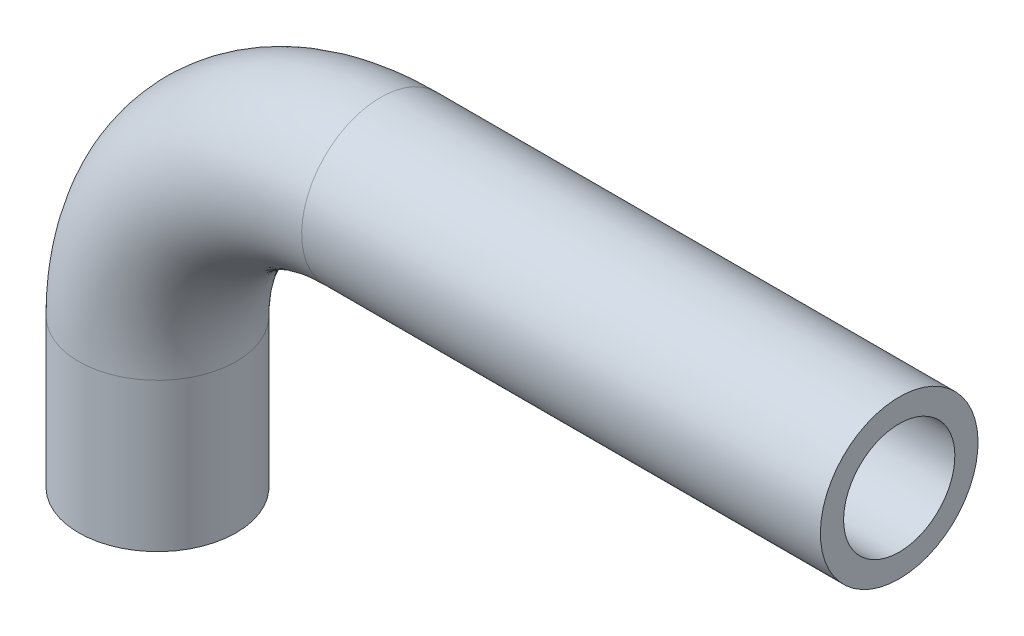
ISO-10303-21;
HEADER;
FILE_DESCRIPTION(('STEP AP214'),'2;1');
FILE_NAME('part.step','',(''),(''),'','','');
FILE_SCHEMA(('AUTOMOTIVE_DESIGN { 1 0 10303 214 1 1 1 1 }'));
ENDSEC;
DATA;
#1=APPLICATION_CONTEXT('core data for automotive mechanical design processes');
#2=APPLICATION_PROTOCOL_DEFINITION('international standard','automotive_design',2000,#1);
#3=PRODUCT_CONTEXT('',#1,'mechanical');
#4=PRODUCT('Part','Part','',(#3));
#5=PRODUCT_RELATED_PRODUCT_CATEGORY('part','',(#4));
#6=PRODUCT_DEFINITION_FORMATION('','',#4);
#7=PRODUCT_DEFINITION_CONTEXT('part definition',#1,'design');
#8=PRODUCT_DEFINITION('design','',#6,#7);
#9=PRODUCT_DEFINITION_SHAPE('','',#8);
#10=(LENGTH_UNIT() NAMED_UNIT(*) SI_UNIT(.MILLI.,.METRE.));
#11=(NAMED_UNIT(*) PLANE_ANGLE_UNIT() SI_UNIT($,.RADIAN.));
#12=(NAMED_UNIT(*) SI_UNIT($,.STERADIAN.) SOLID_ANGLE_UNIT());
#13=UNCERTAINTY_MEASURE_WITH_UNIT(LENGTH_MEASURE(1.E-05),#10,'distance_accuracy_value','');
#14=(GEOMETRIC_REPRESENTATION_CONTEXT(3) GLOBAL_UNCERTAINTY_ASSIGNED_CONTEXT((#13)) GLOBAL_UNIT_ASSIGNED_CONTEXT((#10,
#11,#12)) REPRESENTATION_CONTEXT('',''));
#15=CARTESIAN_POINT('',(0.,0.,0.));
#16=DIRECTION('',(0.,0.,1.));
#17=DIRECTION('',(1.,0.,0.));
#18=AXIS2_PLACEMENT_3D('',#15,#16,#17);
#19=CARTESIAN_POINT('',(0.,0.,0.));
#20=DIRECTION('',(0.,-1.,0.));
#21=DIRECTION('',(1.,0.,0.));
#22=AXIS2_PLACEMENT_3D('',#19,#20,#21);
#23=PLANE('',#22);
#24=CARTESIAN_POINT('',(0.,0.,0.));
#25=DIRECTION('',(0.,-1.,0.));
#26=DIRECTION('',(1.,0.,0.));
#27=AXIS2_PLACEMENT_3D('',#24,#25,#26);
#28=CIRCLE('',#27,9.525);
#29=CARTESIAN_POINT('',(9.525,0.,0.));
#30=VERTEX_POINT('',#29);
#31=EDGE_CURVE('E84',#30,#30,#28,.T.);
#32=ORIENTED_EDGE('',*,*,#31,.F.);
#33=EDGE_LOOP('',(#32));
#34=FACE_BOUND('',#33,.T.);
#35=CARTESIAN_POINT('',(0.,0.,0.));
#36=DIRECTION('',(0.,-1.,0.));
#37=DIRECTION('',(1.,0.,0.));
#38=AXIS2_PLACEMENT_3D('',#35,#36,#37);
#39=CIRCLE('',#38,13.49375);
#40=CARTESIAN_POINT('',(13.49375,0.,0.));
#41=VERTEX_POINT('',#40);
#42=EDGE_CURVE('E78',#41,#41,#39,.T.);
#43=ORIENTED_EDGE('',*,*,#42,.T.);
#44=EDGE_LOOP('',(#43));
#45=FACE_BOUND('',#44,.T.);
#46=ADVANCED_FACE('F61',(#34,#45),#23,.T.);
#47=CARTESIAN_POINT('',(127.,63.4149731702332,0.));
#48=DIRECTION('',(-1.,0.,0.));
#49=DIRECTION('',(0.,-1.,0.));
#50=AXIS2_PLACEMENT_3D('',#47,#48,#49);
#51=PLANE('',#50);
#52=CARTESIAN_POINT('',(127.,63.4149731702329,0.));
#53=DIRECTION('',(-1.,0.,0.));
#54=DIRECTION('',(0.,-1.,0.));
#55=AXIS2_PLACEMENT_3D('',#52,#53,#54);
#56=CIRCLE('',#55,9.525);
#57=CARTESIAN_POINT('',(127.,53.8899731702329,0.));
#58=VERTEX_POINT('',#57);
#59=EDGE_CURVE('E88',#58,#58,#56,.T.);
#60=ORIENTED_EDGE('',*,*,#59,.T.);
#61=EDGE_LOOP('',(#60));
#62=FACE_BOUND('',#61,.T.);
#63=CARTESIAN_POINT('',(127.,63.4149731702332,0.));
#64=DIRECTION('',(-1.,0.,0.));
#65=DIRECTION('',(0.,-1.,0.));
#66=AXIS2_PLACEMENT_3D('',#63,#64,#65);
#67=CIRCLE('',#66,13.49375);
#68=CARTESIAN_POINT('',(127.,49.9212231702332,0.));
#69=VERTEX_POINT('',#68);
#70=EDGE_CURVE('E11',#69,#69,#67,.T.);
#71=ORIENTED_EDGE('',*,*,#70,.F.);
#72=EDGE_LOOP('',(#71));
#73=FACE_BOUND('',#72,.T.);
#74=ADVANCED_FACE('F101',(#62,#73),#51,.F.);
#75=CARTESIAN_POINT('',(0.,0.,0.));
#76=DIRECTION('',(0.,1.,0.));
#77=DIRECTION('',(0.,0.,1.));
#78=AXIS2_PLACEMENT_3D('',#75,#76,#77);
#79=CYLINDRICAL_SURFACE('',#78,13.49375);
#80=CARTESIAN_POINT('',(0.,25.4,0.));
#81=DIRECTION('',(0.,-1.,0.));
#82=DIRECTION('',(1.,0.,0.));
#83=AXIS2_PLACEMENT_3D('',#80,#81,#82);
#84=CIRCLE('',#83,13.49375);
#85=CARTESIAN_POINT('',(13.49375,25.4,0.));
#86=VERTEX_POINT('',#85);
#87=EDGE_CURVE('E73',#86,#86,#84,.T.);
#88=ORIENTED_EDGE('',*,*,#87,.T.);
#89=EDGE_LOOP('',(#88));
#90=FACE_BOUND('',#89,.T.);
#91=ORIENTED_EDGE('',*,*,#42,.F.);
#92=EDGE_LOOP('',(#91));
#93=FACE_BOUND('',#92,.T.);
#94=ADVANCED_FACE('F127',(#90,#93),#79,.T.);
#95=CARTESIAN_POINT('',(13.49375,25.4,0.));
#96=CARTESIAN_POINT('',(13.49375,25.484651748198,0.));
#97=CARTESIAN_POINT('',(13.4940311075775,25.5306667933309,0.));
#98=CARTESIAN_POINT('',(13.4951563423683,25.6616122979596,0.));
#99=CARTESIAN_POINT('',(13.4960004695338,25.7271758186402,0.));
#100=CARTESIAN_POINT('',(13.4993783357394,25.9241194016231,0.));
#101=CARTESIAN_POINT('',(13.5027576418021,26.0557525032821,0.));
#102=CARTESIAN_POINT('',(13.5162824039458,26.4515089730286,0.));
#103=CARTESIAN_POINT('',(13.5298159899676,26.7164897221513,0.));
#104=CARTESIAN_POINT('',(13.5839583220953,27.5136122627928,0.));
#105=CARTESIAN_POINT('',(13.6381284808126,28.0479361546814,0.));
#106=CARTESIAN_POINT('',(13.8540586607736,29.6495442878419,0.));
#107=CARTESIAN_POINT('',(14.0694992107102,30.715250319236,-2.13656084842369E-13));
#108=CARTESIAN_POINT('',(14.9107666695251,33.8189100424923,4.31874252326844E-13));
#109=CARTESIAN_POINT('',(15.7430148247276,35.8145507300846,0.));
#110=CARTESIAN_POINT('',(17.8972766212181,39.5250462800709,0.));
#111=CARTESIAN_POINT('',(19.2184947043196,41.2388102817531,0.));
#112=CARTESIAN_POINT('',(22.2602632242826,44.2670856357725,0.));
#113=CARTESIAN_POINT('',(23.979905262739,45.580691775222,0.));
#114=CARTESIAN_POINT('',(27.7000379719426,47.7184754900043,0.));
#115=CARTESIAN_POINT('',(29.7181017533975,48.5468338294562,0.));
#116=CARTESIAN_POINT('',(32.7974938661069,49.366802955557,0.));
#117=CARTESIAN_POINT('',(33.8491686366522,49.5724781971341,0.));
#118=CARTESIAN_POINT('',(35.4662186050798,49.7813450619886,0.));
#119=CARTESIAN_POINT('',(36.0093963867636,49.8337915172535,0.));
#120=CARTESIAN_POINT('',(36.8254713339173,49.8862461709528,0.));
#121=CARTESIAN_POINT('',(37.0977129434017,49.8993662362709,0.));
#122=CARTESIAN_POINT('',(37.5057715598105,49.9124826283132,0.));
#123=CARTESIAN_POINT('',(37.6417403858011,49.9157610896134,0.));
#124=CARTESIAN_POINT('',(37.8455382617033,49.9190387934745,0.));
#125=CARTESIAN_POINT('',(37.9134449885007,49.9198580481914,0.));
#126=CARTESIAN_POINT('',(38.0491933729436,49.9209502366009,0.));
#127=CARTESIAN_POINT('',(38.0989294256308,49.9212231702334,0.));
#128=CARTESIAN_POINT('',(38.1848374995422,49.9212231702334,0.));
#129=CARTESIAN_POINT('',(13.49375,25.4,26.9875));
#130=CARTESIAN_POINT('',(13.49375,25.484651748198,26.9875));
#131=CARTESIAN_POINT('',(13.4940311075775,25.5306667933309,26.9875));
#132=CARTESIAN_POINT('',(13.4951563423683,25.6616122979596,26.9875));
#133=CARTESIAN_POINT('',(13.4960004695338,25.7271758186402,26.9875));
#134=CARTESIAN_POINT('',(13.4993783357394,25.9241194016231,26.9875));
#135=CARTESIAN_POINT('',(13.502757641802,26.0557525032821,26.9875));
#136=CARTESIAN_POINT('',(13.5162824039457,26.4515089730286,26.9875));
#137=CARTESIAN_POINT('',(13.5298159899676,26.7164897221513,26.9875));
#138=CARTESIAN_POINT('',(13.5839583220952,27.5136122627928,26.9875));
#139=CARTESIAN_POINT('',(13.6381284808126,28.0479361546814,26.9875));
#140=CARTESIAN_POINT('',(13.8540586607736,29.6495442878419,26.9875));
#141=CARTESIAN_POINT('',(14.0694992107102,30.715250319236,26.9874999999998));
#142=CARTESIAN_POINT('',(14.9107666695251,33.8189100424923,26.9875000000004));
#143=CARTESIAN_POINT('',(15.7430148247276,35.8145507300846,26.9875));
#144=CARTESIAN_POINT('',(17.8972766212181,39.5250462800709,26.9875));
#145=CARTESIAN_POINT('',(19.2184947043196,41.2388102817531,26.9875));
#146=CARTESIAN_POINT('',(22.2602632242826,44.2670856357725,26.9875));
#147=CARTESIAN_POINT('',(23.979905262739,45.580691775222,26.9875));
#148=CARTESIAN_POINT('',(27.7000379719426,47.7184754900043,26.9875));
#149=CARTESIAN_POINT('',(29.7181017533975,48.5468338294562,26.9875));
#150=CARTESIAN_POINT('',(32.7974938661069,49.366802955557,26.9875));
#151=CARTESIAN_POINT('',(33.8491686366522,49.5724781971341,26.9875));
#152=CARTESIAN_POINT('',(35.4662186050798,49.7813450619886,26.9875));
#153=CARTESIAN_POINT('',(36.0093963867636,49.8337915172535,26.9875));
#154=CARTESIAN_POINT('',(36.8254713339173,49.8862461709528,26.9875));
#155=CARTESIAN_POINT('',(37.0977129434017,49.8993662362709,26.9875));
#156=CARTESIAN_POINT('',(37.5057715598105,49.9124826283132,26.9875));
#157=CARTESIAN_POINT('',(37.6417403858011,49.9157610896134,26.9875));
#158=CARTESIAN_POINT('',(37.8455382617033,49.9190387934745,26.9875));
#159=CARTESIAN_POINT('',(37.9134449885007,49.9198580481914,26.9875));
#160=CARTESIAN_POINT('',(38.0491933729436,49.9209502366009,26.9875));
#161=CARTESIAN_POINT('',(38.0989294256308,49.9212231702334,26.9875));
#162=CARTESIAN_POINT('',(38.1848374995422,49.9212231702334,26.9875));
#163=CARTESIAN_POINT('',(-13.49375,25.4,26.9875));
#164=CARTESIAN_POINT('',(-13.49375,25.5233856258005,26.9875));
#165=CARTESIAN_POINT('',(-13.4931353543173,25.6854329149467,26.9875));
#166=CARTESIAN_POINT('',(-13.4906844874876,25.970644499579,26.9875));
#167=CARTESIAN_POINT('',(-13.4888482662321,26.1131757342366,26.9875));
#168=CARTESIAN_POINT('',(-13.4815183723497,26.5405388933777,26.9875));
#169=CARTESIAN_POINT('',(-13.4742036147157,26.8251402305192,26.9875));
#170=CARTESIAN_POINT('',(-13.4450586673649,27.6779686488461,26.9875));
#171=CARTESIAN_POINT('',(-13.4160300872359,28.2452196739653,26.9875));
#172=CARTESIAN_POINT('',(-13.3007359148782,29.9426638009092,26.9875));
#173=CARTESIAN_POINT('',(-13.1862970730364,31.0685463904676,26.9875));
#174=CARTESIAN_POINT('',(-12.7336576000543,34.4258865346447,26.9875));
#175=CARTESIAN_POINT('',(-12.2866086250164,36.6373723986782,26.9874999999998));
#176=CARTESIAN_POINT('',(-10.5221264858014,43.1470170742619,26.9875000000004));
#177=CARTESIAN_POINT('',(-8.77744573481836,47.3301126146488,26.9875));
#178=CARTESIAN_POINT('',(-4.26044519375874,55.1101839291124,26.9875));
#179=CARTESIAN_POINT('',(-1.49014921305795,58.7035600617329,26.9875));
#180=CARTESIAN_POINT('',(4.88775252230891,65.0531696749012,26.9875));
#181=CARTESIAN_POINT('',(8.49345357070718,67.8075051285883,26.9875));
#182=CARTESIAN_POINT('',(16.2937318319361,72.2899548532247,26.9875));
#183=CARTESIAN_POINT('',(20.4660314120632,74.0110926480716,26.9875));
#184=CARTESIAN_POINT('',(27.0116192959856,75.7540262651797,26.9875));
#185=CARTESIAN_POINT('',(29.2401122858175,76.1888420733263,26.9875));
#186=CARTESIAN_POINT('',(32.5850503108985,76.6208922463185,26.9875));
#187=CARTESIAN_POINT('',(33.7028539629862,76.7287264331512,26.9875));
#188=CARTESIAN_POINT('',(35.3820974386893,76.8366627634117,26.9875));
#189=CARTESIAN_POINT('',(35.9422696713218,76.8636644789466,26.9875));
#190=CARTESIAN_POINT('',(36.7829597954544,76.8906871193322,26.9875));
#191=CARTESIAN_POINT('',(37.0632618234367,76.8974475095453,26.9875));
#192=CARTESIAN_POINT('',(37.4837972936054,76.9042110281833,26.9875));
#193=CARTESIAN_POINT('',(37.6239895212007,76.9059026582796,26.9875));
#194=CARTESIAN_POINT('',(37.9043971795524,76.9081587292782,26.9875));
#195=CARTESIAN_POINT('',(38.0627182155668,76.9087231702334,26.9875));
#196=CARTESIAN_POINT('',(38.1848374995423,76.9087231702334,26.9875));
#197=CARTESIAN_POINT('',(-13.49375,25.4,0.));
#198=CARTESIAN_POINT('',(-13.49375,25.5233856258005,0.));
#199=CARTESIAN_POINT('',(-13.4931353543173,25.6854329149467,0.));
#200=CARTESIAN_POINT('',(-13.4906844874876,25.970644499579,0.));
#201=CARTESIAN_POINT('',(-13.4888482662321,26.1131757342366,0.));
#202=CARTESIAN_POINT('',(-13.4815183723497,26.5405388933777,0.));
#203=CARTESIAN_POINT('',(-13.4742036147157,26.8251402305192,0.));
#204=CARTESIAN_POINT('',(-13.4450586673649,27.6779686488461,0.));
#205=CARTESIAN_POINT('',(-13.4160300872359,28.2452196739653,0.));
#206=CARTESIAN_POINT('',(-13.3007359148782,29.9426638009092,0.));
#207=CARTESIAN_POINT('',(-13.1862970730364,31.0685463904676,0.));
#208=CARTESIAN_POINT('',(-12.7336576000543,34.4258865346447,0.));
#209=CARTESIAN_POINT('',(-12.2866086250164,36.6373723986782,-2.1200357706777E-13));
#210=CARTESIAN_POINT('',(-10.5221264858014,43.1470170742619,4.33526760101444E-13));
#211=CARTESIAN_POINT('',(-8.77744573481836,47.3301126146488,0.));
#212=CARTESIAN_POINT('',(-4.26044519375874,55.1101839291124,0.));
#213=CARTESIAN_POINT('',(-1.49014921305795,58.7035600617329,0.));
#214=CARTESIAN_POINT('',(4.88775252230891,65.0531696749012,0.));
#215=CARTESIAN_POINT('',(8.49345357070718,67.8075051285883,0.));
#216=CARTESIAN_POINT('',(16.2937318319361,72.2899548532247,0.));
#217=CARTESIAN_POINT('',(20.4660314120632,74.0110926480716,0.));
#218=CARTESIAN_POINT('',(27.0116192959856,75.7540262651797,0.));
#219=CARTESIAN_POINT('',(29.2401122858175,76.1888420733263,0.));
#220=CARTESIAN_POINT('',(32.5850503108985,76.6208922463185,0.));
#221=CARTESIAN_POINT('',(33.7028539629862,76.7287264331512,0.));
#222=CARTESIAN_POINT('',(35.3820974386893,76.8366627634117,0.));
#223=CARTESIAN_POINT('',(35.9422696713218,76.8636644789466,0.));
#224=CARTESIAN_POINT('',(36.7829597954544,76.8906871193322,0.));
#225=CARTESIAN_POINT('',(37.0632618234367,76.8974475095453,0.));
#226=CARTESIAN_POINT('',(37.4837972936054,76.9042110281833,0.));
#227=CARTESIAN_POINT('',(37.6239895212007,76.9059026582796,0.));
#228=CARTESIAN_POINT('',(37.9043971795524,76.9081587292782,0.));
#229=CARTESIAN_POINT('',(38.0627182155668,76.9087231702334,0.));
#230=CARTESIAN_POINT('',(38.1848374995423,76.9087231702334,0.));
#231=CARTESIAN_POINT('',(-13.49375,25.4,-26.9875));
#232=CARTESIAN_POINT('',(-13.49375,25.5233856258005,-26.9875));
#233=CARTESIAN_POINT('',(-13.4931353543173,25.6854329149467,-26.9875));
#234=CARTESIAN_POINT('',(-13.4906844874876,25.970644499579,-26.9875));
#235=CARTESIAN_POINT('',(-13.4888482662321,26.1131757342366,-26.9875));
#236=CARTESIAN_POINT('',(-13.4815183723497,26.5405388933777,-26.9875));
#237=CARTESIAN_POINT('',(-13.4742036147157,26.8251402305192,-26.9875));
#238=CARTESIAN_POINT('',(-13.4450586673649,27.6779686488461,-26.9875));
#239=CARTESIAN_POINT('',(-13.4160300872359,28.2452196739653,-26.9875));
#240=CARTESIAN_POINT('',(-13.3007359148782,29.9426638009092,-26.9875));
#241=CARTESIAN_POINT('',(-13.1862970730364,31.0685463904676,-26.9875));
#242=CARTESIAN_POINT('',(-12.7336576000543,34.4258865346447,-26.9875));
#243=CARTESIAN_POINT('',(-12.2866086250164,36.6373723986782,-26.9875000000002));
#244=CARTESIAN_POINT('',(-10.5221264858014,43.1470170742619,-26.9874999999996));
#245=CARTESIAN_POINT('',(-8.77744573481836,47.3301126146488,-26.9875));
#246=CARTESIAN_POINT('',(-4.26044519375874,55.1101839291124,-26.9875));
#247=CARTESIAN_POINT('',(-1.49014921305795,58.7035600617329,-26.9875));
#248=CARTESIAN_POINT('',(4.88775252230891,65.0531696749012,-26.9875));
#249=CARTESIAN_POINT('',(8.49345357070718,67.8075051285883,-26.9875));
#250=CARTESIAN_POINT('',(16.2937318319361,72.2899548532247,-26.9875));
#251=CARTESIAN_POINT('',(20.4660314120632,74.0110926480716,-26.9875));
#252=CARTESIAN_POINT('',(27.0116192959856,75.7540262651797,-26.9875));
#253=CARTESIAN_POINT('',(29.2401122858175,76.1888420733263,-26.9875));
#254=CARTESIAN_POINT('',(32.5850503108985,76.6208922463185,-26.9875));
#255=CARTESIAN_POINT('',(33.7028539629862,76.7287264331512,-26.9875));
#256=CARTESIAN_POINT('',(35.3820974386893,76.8366627634117,-26.9875));
#257=CARTESIAN_POINT('',(35.9422696713218,76.8636644789466,-26.9875));
#258=CARTESIAN_POINT('',(36.7829597954544,76.8906871193322,-26.9875));
#259=CARTESIAN_POINT('',(37.0632618234367,76.8974475095453,-26.9875));
#260=CARTESIAN_POINT('',(37.4837972936054,76.9042110281833,-26.9875));
#261=CARTESIAN_POINT('',(37.6239895212007,76.9059026582796,-26.9875));
#262=CARTESIAN_POINT('',(37.9043971795524,76.9081587292782,-26.9875));
#263=CARTESIAN_POINT('',(38.0627182155668,76.9087231702334,-26.9875));
#264=CARTESIAN_POINT('',(38.1848374995423,76.9087231702334,-26.9875));
#265=CARTESIAN_POINT('',(13.49375,25.4,-26.9875));
#266=CARTESIAN_POINT('',(13.49375,25.484651748198,-26.9875));
#267=CARTESIAN_POINT('',(13.4940311075775,25.5306667933309,-26.9875));
#268=CARTESIAN_POINT('',(13.4951563423683,25.6616122979596,-26.9875));
#269=CARTESIAN_POINT('',(13.4960004695338,25.7271758186402,-26.9875));
#270=CARTESIAN_POINT('',(13.4993783357394,25.9241194016231,-26.9875));
#271=CARTESIAN_POINT('',(13.502757641802,26.0557525032821,-26.9875));
#272=CARTESIAN_POINT('',(13.5162824039457,26.4515089730286,-26.9875));
#273=CARTESIAN_POINT('',(13.5298159899676,26.7164897221513,-26.9875));
#274=CARTESIAN_POINT('',(13.5839583220952,27.5136122627928,-26.9875));
#275=CARTESIAN_POINT('',(13.6381284808126,28.0479361546814,-26.9875));
#276=CARTESIAN_POINT('',(13.8540586607736,29.6495442878419,-26.9875));
#277=CARTESIAN_POINT('',(14.0694992107102,30.715250319236,-26.9875000000002));
#278=CARTESIAN_POINT('',(14.9107666695251,33.8189100424923,-26.9874999999996));
#279=CARTESIAN_POINT('',(15.7430148247276,35.8145507300846,-26.9875));
#280=CARTESIAN_POINT('',(17.8972766212181,39.5250462800709,-26.9875));
#281=CARTESIAN_POINT('',(19.2184947043196,41.2388102817531,-26.9875));
#282=CARTESIAN_POINT('',(22.2602632242826,44.2670856357725,-26.9875));
#283=CARTESIAN_POINT('',(23.979905262739,45.580691775222,-26.9875));
#284=CARTESIAN_POINT('',(27.7000379719426,47.7184754900043,-26.9875));
#285=CARTESIAN_POINT('',(29.7181017533975,48.5468338294562,-26.9875));
#286=CARTESIAN_POINT('',(32.7974938661069,49.366802955557,-26.9875));
#287=CARTESIAN_POINT('',(33.8491686366522,49.5724781971341,-26.9875));
#288=CARTESIAN_POINT('',(35.4662186050798,49.7813450619886,-26.9875));
#289=CARTESIAN_POINT('',(36.0093963867636,49.8337915172535,-26.9875));
#290=CARTESIAN_POINT('',(36.8254713339173,49.8862461709528,-26.9875));
#291=CARTESIAN_POINT('',(37.0977129434017,49.8993662362709,-26.9875));
#292=CARTESIAN_POINT('',(37.5057715598105,49.9124826283132,-26.9875));
#293=CARTESIAN_POINT('',(37.6417403858011,49.9157610896134,-26.9875));
#294=CARTESIAN_POINT('',(37.8455382617033,49.9190387934745,-26.9875));
#295=CARTESIAN_POINT('',(37.9134449885007,49.9198580481914,-26.9875));
#296=CARTESIAN_POINT('',(38.0491933729436,49.9209502366009,-26.9875));
#297=CARTESIAN_POINT('',(38.0989294256308,49.9212231702334,-26.9875));
#298=CARTESIAN_POINT('',(38.1848374995422,49.9212231702334,-26.9875));
#299=CARTESIAN_POINT('',(13.49375,25.4,0.));
#300=CARTESIAN_POINT('',(13.49375,25.484651748198,0.));
#301=CARTESIAN_POINT('',(13.4940311075775,25.5306667933309,0.));
#302=CARTESIAN_POINT('',(13.4951563423683,25.6616122979596,0.));
#303=CARTESIAN_POINT('',(13.4960004695338,25.7271758186402,0.));
#304=CARTESIAN_POINT('',(13.4993783357394,25.9241194016231,0.));
#305=CARTESIAN_POINT('',(13.5027576418021,26.0557525032821,0.));
#306=CARTESIAN_POINT('',(13.5162824039458,26.4515089730286,0.));
#307=CARTESIAN_POINT('',(13.5298159899676,26.7164897221513,0.));
#308=CARTESIAN_POINT('',(13.5839583220953,27.5136122627928,0.));
#309=CARTESIAN_POINT('',(13.6381284808126,28.0479361546814,0.));
#310=CARTESIAN_POINT('',(13.8540586607736,29.6495442878419,0.));
#311=CARTESIAN_POINT('',(14.0694992107102,30.715250319236,-2.13656084842369E-13));
#312=CARTESIAN_POINT('',(14.9107666695251,33.8189100424923,4.31874252326844E-13));
#313=CARTESIAN_POINT('',(15.7430148247276,35.8145507300846,0.));
#314=CARTESIAN_POINT('',(17.8972766212181,39.5250462800709,0.));
#315=CARTESIAN_POINT('',(19.2184947043196,41.2388102817531,0.));
#316=CARTESIAN_POINT('',(22.2602632242826,44.2670856357725,0.));
#317=CARTESIAN_POINT('',(23.979905262739,45.580691775222,0.));
#318=CARTESIAN_POINT('',(27.7000379719426,47.7184754900043,0.));
#319=CARTESIAN_POINT('',(29.7181017533975,48.5468338294562,0.));
#320=CARTESIAN_POINT('',(32.7974938661069,49.366802955557,0.));
#321=CARTESIAN_POINT('',(33.8491686366522,49.5724781971341,0.));
#322=CARTESIAN_POINT('',(35.4662186050798,49.7813450619886,0.));
#323=CARTESIAN_POINT('',(36.0093963867636,49.8337915172535,0.));
#324=CARTESIAN_POINT('',(36.8254713339173,49.8862461709528,0.));
#325=CARTESIAN_POINT('',(37.0977129434017,49.8993662362709,0.));
#326=CARTESIAN_POINT('',(37.5057715598105,49.9124826283132,0.));
#327=CARTESIAN_POINT('',(37.6417403858011,49.9157610896134,0.));
#328=CARTESIAN_POINT('',(37.8455382617033,49.9190387934745,0.));
#329=CARTESIAN_POINT('',(37.9134449885007,49.9198580481914,0.));
#330=CARTESIAN_POINT('',(38.0491933729436,49.9209502366009,0.));
#331=CARTESIAN_POINT('',(38.0989294256308,49.9212231702334,0.));
#332=CARTESIAN_POINT('',(38.1848374995422,49.9212231702334,0.));
#333=(BOUNDED_SURFACE() B_SPLINE_SURFACE(3,3,((#95,#96,#97,#98,#99,#100,#101,#102,#103,#104,
#105,#106,#107,#108,#109,#110,#111,#112,#113,#114,#115,#116,#117,#118,#119,#120,#121,#122,#123,
#124,#125,#126,#127,#128),(#129,#130,#131,#132,#133,#134,#135,#136,#137,#138,#139,#140,#141,
#142,#143,#144,#145,#146,#147,#148,#149,#150,#151,#152,#153,#154,#155,#156,#157,#158,#159,#160,
#161,#162),(#163,#164,#165,#166,#167,#168,#169,#170,#171,#172,#173,#174,#175,#176,#177,#178,
#179,#180,#181,#182,#183,#184,#185,#186,#187,#188,#189,#190,#191,#192,#193,#194,#195,#196),
(#197,#198,#199,#200,#201,#202,#203,#204,#205,#206,#207,#208,#209,#210,#211,#212,#213,#214,#215,
#216,#217,#218,#219,#220,#221,#222,#223,#224,#225,#226,#227,#228,#229,#230),(#231,#232,#233,
#234,#235,#236,#237,#238,#239,#240,#241,#242,#243,#244,#245,#246,#247,#248,#249,#250,#251,#252,
#253,#254,#255,#256,#257,#258,#259,#260,#261,#262,#263,#264),(#265,#266,#267,#268,#269,#270,
#271,#272,#273,#274,#275,#276,#277,#278,#279,#280,#281,#282,#283,#284,#285,#286,#287,#288,#289,
#290,#291,#292,#293,#294,#295,#296,#297,#298),(#299,#300,#301,#302,#303,#304,#305,#306,#307,
#308,#309,#310,#311,#312,#313,#314,#315,#316,#317,#318,#319,#320,#321,#322,#323,#324,#325,#326,
#327,#328,#329,#330,#331,#332)),.UNSPECIFIED.,.T.,.F.,.F.) B_SPLINE_SURFACE_WITH_KNOTS((4,3,4),
(4,2,2,2,2,2,2,2,2,2,2,2,2,2,2,2,4),(0.,0.5,1.),(0.145924918342966,0.147720306144015,
0.149515693945064,0.153106469547163,0.16028802075136,0.174651123159753,0.203377327976541,
0.260608822495339,0.317840317014137,0.375071811532935,0.432303306051733,0.461026744846801,
0.475388464244335,0.482569323943102,0.486159753792485,0.487954968717177,0.489750183641869),
.UNSPECIFIED.) GEOMETRIC_REPRESENTATION_ITEM() RATIONAL_B_SPLINE_SURFACE(((1.,1.,1.,1.,1.,1.,1.,
1.,1.,1.,1.,1.,1.,1.,1.,1.,1.,1.,1.,1.,1.,1.,1.,1.,1.,1.,1.,1.,1.,1.,1.,1.,1.,1.),
(0.333333333333333,0.333333333333333,0.333333333333333,0.333333333333333,0.333333333333333,
0.333333333333333,0.333333333333333,0.333333333333333,0.333333333333333,0.333333333333333,
0.333333333333333,0.333333333333333,0.333333333333333,0.333333333333333,0.333333333333333,
0.333333333333333,0.333333333333333,0.333333333333333,0.333333333333333,0.333333333333333,
0.333333333333333,0.333333333333333,0.333333333333333,0.333333333333333,0.333333333333333,
0.333333333333333,0.333333333333333,0.333333333333333,0.333333333333333,0.333333333333333,
0.333333333333333,0.333333333333333,0.333333333333333,0.333333333333333),(0.333333333333333,
0.333333333333333,0.333333333333333,0.333333333333333,0.333333333333333,0.333333333333333,
0.333333333333333,0.333333333333333,0.333333333333333,0.333333333333333,0.333333333333333,
0.333333333333333,0.333333333333333,0.333333333333333,0.333333333333333,0.333333333333333,
0.333333333333333,0.333333333333333,0.333333333333333,0.333333333333333,0.333333333333333,
0.333333333333333,0.333333333333333,0.333333333333333,0.333333333333333,0.333333333333333,
0.333333333333333,0.333333333333333,0.333333333333333,0.333333333333333,0.333333333333333,
0.333333333333333,0.333333333333333,0.333333333333333),(1.,1.,1.,1.,1.,1.,1.,1.,1.,1.,1.,1.,1.,
1.,1.,1.,1.,1.,1.,1.,1.,1.,1.,1.,1.,1.,1.,1.,1.,1.,1.,1.,1.,1.),(0.333333333333333,
0.333333333333333,0.333333333333333,0.333333333333333,0.333333333333333,0.333333333333333,
0.333333333333333,0.333333333333333,0.333333333333333,0.333333333333333,0.333333333333333,
0.333333333333333,0.333333333333333,0.333333333333333,0.333333333333333,0.333333333333333,
0.333333333333333,0.333333333333333,0.333333333333333,0.333333333333333,0.333333333333333,
0.333333333333333,0.333333333333333,0.333333333333333,0.333333333333333,0.333333333333333,
0.333333333333333,0.333333333333333,0.333333333333333,0.333333333333333,0.333333333333333,
0.333333333333333,0.333333333333333,0.333333333333333),(0.333333333333333,0.333333333333333,
0.333333333333333,0.333333333333333,0.333333333333333,0.333333333333333,0.333333333333333,
0.333333333333333,0.333333333333333,0.333333333333333,0.333333333333333,0.333333333333333,
0.333333333333333,0.333333333333333,0.333333333333333,0.333333333333333,0.333333333333333,
0.333333333333333,0.333333333333333,0.333333333333333,0.333333333333333,0.333333333333333,
0.333333333333333,0.333333333333333,0.333333333333333,0.333333333333333,0.333333333333333,
0.333333333333333,0.333333333333333,0.333333333333333,0.333333333333333,0.333333333333333,
0.333333333333333,0.333333333333333),(1.,1.,1.,1.,1.,1.,1.,1.,1.,1.,1.,1.,1.,1.,1.,1.,1.,1.,1.,
1.,1.,1.,1.,1.,1.,1.,1.,1.,1.,1.,1.,1.,1.,1.))) REPRESENTATION_ITEM('') SURFACE());
#334=CARTESIAN_POINT('',(38.1848374995424,63.4149731702331,0.));
#335=DIRECTION('',(-1.,0.,0.));
#336=DIRECTION('',(0.,-1.,0.));
#337=AXIS2_PLACEMENT_3D('',#334,#335,#336);
#338=CIRCLE('',#337,13.49375);
#339=CARTESIAN_POINT('',(38.1848374995423,49.9212231702331,0.));
#340=VERTEX_POINT('',#339);
#341=EDGE_CURVE('E68',#340,#340,#338,.T.);
#342=ORIENTED_EDGE('',*,*,#341,.T.);
#343=EDGE_LOOP('',(#342));
#344=FACE_BOUND('',#343,.T.);
#345=ORIENTED_EDGE('',*,*,#87,.F.);
#346=EDGE_LOOP('',(#345));
#347=FACE_BOUND('',#346,.T.);
#348=ADVANCED_FACE('F129',(#344,#347),#333,.F.);
#349=CARTESIAN_POINT('',(38.1848374995422,63.4149731702334,0.));
#350=DIRECTION('',(1.,0.,0.));
#351=DIRECTION('',(0.,1.,0.));
#352=AXIS2_PLACEMENT_3D('',#349,#350,#351);
#353=CYLINDRICAL_SURFACE('',#352,13.49375);
#354=ORIENTED_EDGE('',*,*,#70,.T.);
#355=EDGE_LOOP('',(#354));
#356=FACE_BOUND('',#355,.T.);
#357=ORIENTED_EDGE('',*,*,#341,.F.);
#358=EDGE_LOOP('',(#357));
#359=FACE_BOUND('',#358,.T.);
#360=ADVANCED_FACE('F119',(#356,#359),#353,.T.);
#361=CARTESIAN_POINT('',(0.,-1.,0.));
#362=DIRECTION('',(0.,1.,0.));
#363=DIRECTION('',(0.,0.,1.));
#364=AXIS2_PLACEMENT_3D('',#361,#362,#363);
#365=CYLINDRICAL_SURFACE('',#364,9.525);
#366=CARTESIAN_POINT('',(0.,25.4,0.));
#367=DIRECTION('',(0.,-1.,0.));
#368=DIRECTION('',(1.,0.,0.));
#369=AXIS2_PLACEMENT_3D('',#366,#367,#368);
#370=CIRCLE('',#369,9.525);
#371=CARTESIAN_POINT('',(9.525,25.4,0.));
#372=VERTEX_POINT('',#371);
#373=EDGE_CURVE('E89',#372,#372,#370,.T.);
#374=ORIENTED_EDGE('',*,*,#373,.F.);
#375=EDGE_LOOP('',(#374));
#376=FACE_BOUND('',#375,.T.);
#377=ORIENTED_EDGE('',*,*,#31,.T.);
#378=EDGE_LOOP('',(#377));
#379=FACE_BOUND('',#378,.T.);
#380=ADVANCED_FACE('F109',(#376,#379),#365,.F.);
#381=CARTESIAN_POINT('',(9.52499999999999,25.4,0.));
#382=CARTESIAN_POINT('',(9.52499999999999,25.490347906669,0.));
#383=CARTESIAN_POINT('',(9.52533015729814,25.5534265170984,0.));
#384=CARTESIAN_POINT('',(9.52665033797841,25.707058209962,0.));
#385=CARTESIAN_POINT('',(9.52764036133226,25.783940512109,0.));
#386=CARTESIAN_POINT('',(9.53159940808059,26.0147693268837,0.));
#387=CARTESIAN_POINT('',(9.53555745702066,26.1688977572887,0.));
#388=CARTESIAN_POINT('',(9.55137930522233,26.6318706900584,0.));
#389=CARTESIAN_POINT('',(9.56719156684805,26.941302950368,0.));
#390=CARTESIAN_POINT('',(9.63032681666082,27.8708257242632,0.));
#391=CARTESIAN_POINT('',(9.69336001701352,28.4921435423044,0.));
#392=CARTESIAN_POINT('',(9.94410038711795,30.3519475594158,0.));
#393=CARTESIAN_POINT('',(10.1936009995716,31.5861506250194,-2.13656084842005E-13));
#394=CARTESIAN_POINT('',(11.8211545316438,37.5906291212948,8.61674796534738E-13));
#395=CARTESIAN_POINT('',(14.4069177201333,42.048802406396,0.));
#396=CARTESIAN_POINT('',(19.7054822386625,47.3238627002891,0.));
#397=CARTESIAN_POINT('',(21.7024858962893,48.8493407977663,0.));
#398=CARTESIAN_POINT('',(26.0226400101514,51.3319283375464,0.));
#399=CARTESIAN_POINT('',(28.3575031738407,52.2915777733466,0.));
#400=CARTESIAN_POINT('',(31.9466299587105,53.2472769716898,0.));
#401=CARTESIAN_POINT('',(33.1713662320818,53.4866493554038,0.));
#402=CARTESIAN_POINT('',(35.0425173853652,53.7283372949752,0.));
#403=CARTESIAN_POINT('',(35.6701989714954,53.7889290048704,0.));
#404=CARTESIAN_POINT('',(36.6132104669754,53.8495427286749,0.));
#405=CARTESIAN_POINT('',(36.9277948151518,53.8647042131346,0.));
#406=CARTESIAN_POINT('',(37.3994757121125,53.8798656416986,0.));
#407=CARTESIAN_POINT('',(37.5566700089774,53.8836561513683,0.));
#408=CARTESIAN_POINT('',(37.792341060515,53.8874464750492,0.));
#409=CARTESIAN_POINT('',(37.870878008019,53.8883940202637,0.));
#410=CARTESIAN_POINT('',(38.0278998150884,53.8896573678764,0.));
#411=CARTESIAN_POINT('',(38.0936042476804,53.8899731702331,0.));
#412=CARTESIAN_POINT('',(38.1848374995424,53.8899731702331,0.));
#413=CARTESIAN_POINT('',(9.52499999999998,25.4,19.05));
#414=CARTESIAN_POINT('',(9.52499999999998,25.490347906669,19.05));
#415=CARTESIAN_POINT('',(9.52533015729814,25.5534265170984,19.05));
#416=CARTESIAN_POINT('',(9.5266503379784,25.707058209962,19.05));
#417=CARTESIAN_POINT('',(9.52764036133225,25.783940512109,19.05));
#418=CARTESIAN_POINT('',(9.53159940808058,26.0147693268837,19.05));
#419=CARTESIAN_POINT('',(9.53555745702065,26.1688977572887,19.05));
#420=CARTESIAN_POINT('',(9.55137930522232,26.6318706900584,19.05));
#421=CARTESIAN_POINT('',(9.56719156684804,26.941302950368,19.05));
#422=CARTESIAN_POINT('',(9.63032681666081,27.8708257242632,19.05));
#423=CARTESIAN_POINT('',(9.69336001701351,28.4921435423044,19.05));
#424=CARTESIAN_POINT('',(9.94410038711794,30.3519475594158,19.05));
#425=CARTESIAN_POINT('',(10.1936009995716,31.5861506250194,19.0499999999998));
#426=CARTESIAN_POINT('',(11.8211545316438,37.5906291212948,19.0500000000009));
#427=CARTESIAN_POINT('',(14.4069177201333,42.048802406396,19.05));
#428=CARTESIAN_POINT('',(19.7054822386625,47.3238627002891,19.05));
#429=CARTESIAN_POINT('',(21.7024858962893,48.8493407977663,19.05));
#430=CARTESIAN_POINT('',(26.0226400101514,51.3319283375464,19.05));
#431=CARTESIAN_POINT('',(28.3575031738407,52.2915777733466,19.05));
#432=CARTESIAN_POINT('',(31.9466299587105,53.2472769716899,19.05));
#433=CARTESIAN_POINT('',(33.1713662320818,53.4866493554038,19.05));
#434=CARTESIAN_POINT('',(35.0425173853652,53.7283372949752,19.05));
#435=CARTESIAN_POINT('',(35.6701989714954,53.7889290048704,19.05));
#436=CARTESIAN_POINT('',(36.6132104669754,53.8495427286749,19.05));
#437=CARTESIAN_POINT('',(36.9277948151518,53.8647042131346,19.05));
#438=CARTESIAN_POINT('',(37.3994757121125,53.8798656416986,19.05));
#439=CARTESIAN_POINT('',(37.5566700089774,53.8836561513684,19.05));
#440=CARTESIAN_POINT('',(37.792341060515,53.8874464750492,19.05));
#441=CARTESIAN_POINT('',(37.870878008019,53.8883940202637,19.05));
#442=CARTESIAN_POINT('',(38.0278998150884,53.8896573678765,19.05));
#443=CARTESIAN_POINT('',(38.0936042476804,53.8899731702331,19.05));
#444=CARTESIAN_POINT('',(38.1848374995424,53.8899731702331,19.05));
#445=CARTESIAN_POINT('',(-9.52500000000001,25.4,19.05));
#446=CARTESIAN_POINT('',(-9.52500000000001,25.5176894673296,19.05));
#447=CARTESIAN_POINT('',(-9.52443440403938,25.6626731911809,19.05));
#448=CARTESIAN_POINT('',(-9.52217848309625,25.925198587575,19.05));
#449=CARTESIAN_POINT('',(-9.52048815803235,26.0564110407671,19.05));
#450=CARTESIAN_POINT('',(-9.51373944468726,26.4498889681188,19.05));
#451=CARTESIAN_POINT('',(-9.50700342993496,26.7119949765167,19.05));
#452=CARTESIAN_POINT('',(-9.48015556864011,27.4976069318084,19.05));
#453=CARTESIAN_POINT('',(-9.45340566412083,28.020406445758,19.05));
#454=CARTESIAN_POINT('',(-9.34710440943476,29.5854503394204,19.05));
#455=CARTESIAN_POINT('',(-9.24152860923462,30.6243390028666,19.05));
#456=CARTESIAN_POINT('',(-8.82369932640415,33.723483263027,19.05));
#457=CARTESIAN_POINT('',(-8.41071041387629,35.7664720928772,19.0499999999998));
#458=CARTESIAN_POINT('',(-5.69758024673754,45.7759320546361,19.0500000000009));
#459=CARTESIAN_POINT('',(-1.38840735639273,53.2046254536399,19.05));
#460=CARTESIAN_POINT('',(7.44253350785718,61.9963926103129,19.05));
#461=CARTESIAN_POINT('',(10.7708729372237,64.5388561060659,19.05));
#462=CARTESIAN_POINT('',(17.9711297936605,68.676502005661,19.05));
#463=CARTESIAN_POINT('',(21.8266299916067,70.2663487041317,19.05));
#464=CARTESIAN_POINT('',(27.8624832033888,71.8735522490717,19.05));
#465=CARTESIAN_POINT('',(29.9179146903283,72.2746709150826,19.05));
#466=CARTESIAN_POINT('',(33.0087515306431,72.673900013319,19.05));
#467=CARTESIAN_POINT('',(34.0420513782863,72.7735889455052,19.05));
#468=CARTESIAN_POINT('',(35.5943583056151,72.8733662057041,19.05));
#469=CARTESIAN_POINT('',(36.1121877995646,72.8983265020785,19.05));
#470=CARTESIAN_POINT('',(36.889255643156,72.923304105949,19.05));
#471=CARTESIAN_POINT('',(37.1483322002601,72.9295524477896,19.05));
#472=CARTESIAN_POINT('',(37.5369944947937,72.935803346609,19.05));
#473=CARTESIAN_POINT('',(37.6665565016823,72.9373666862084,19.05));
#474=CARTESIAN_POINT('',(37.925690737408,72.9394515980015,19.05));
#475=CARTESIAN_POINT('',(38.0680433935175,72.9399731702331,19.05));
#476=CARTESIAN_POINT('',(38.1848374995424,72.9399731702331,19.05));
#477=CARTESIAN_POINT('',(-9.52500000000001,25.4,0.));
#478=CARTESIAN_POINT('',(-9.52500000000001,25.5176894673296,0.));
#479=CARTESIAN_POINT('',(-9.52443440403938,25.6626731911809,0.));
#480=CARTESIAN_POINT('',(-9.52217848309625,25.925198587575,0.));
#481=CARTESIAN_POINT('',(-9.52048815803235,26.0564110407671,0.));
#482=CARTESIAN_POINT('',(-9.51373944468726,26.4498889681188,0.));
#483=CARTESIAN_POINT('',(-9.50700342993496,26.7119949765167,0.));
#484=CARTESIAN_POINT('',(-9.48015556864011,27.4976069318084,0.));
#485=CARTESIAN_POINT('',(-9.45340566412083,28.020406445758,0.));
#486=CARTESIAN_POINT('',(-9.34710440943476,29.5854503394204,0.));
#487=CARTESIAN_POINT('',(-9.24152860923462,30.6243390028666,0.));
#488=CARTESIAN_POINT('',(-8.82369932640415,33.723483263027,0.));
#489=CARTESIAN_POINT('',(-8.41071041387629,35.7664720928772,-2.12489608765818E-13));
#490=CARTESIAN_POINT('',(-5.69758024673754,45.7759320546361,8.62841272610926E-13));
#491=CARTESIAN_POINT('',(-1.38840735639273,53.2046254536399,0.));
#492=CARTESIAN_POINT('',(7.44253350785718,61.9963926103129,0.));
#493=CARTESIAN_POINT('',(10.7708729372237,64.5388561060659,0.));
#494=CARTESIAN_POINT('',(17.9711297936605,68.676502005661,0.));
#495=CARTESIAN_POINT('',(21.8266299916067,70.2663487041317,0.));
#496=CARTESIAN_POINT('',(27.8624832033888,71.8735522490717,0.));
#497=CARTESIAN_POINT('',(29.9179146903283,72.2746709150826,0.));
#498=CARTESIAN_POINT('',(33.0087515306431,72.673900013319,0.));
#499=CARTESIAN_POINT('',(34.0420513782863,72.7735889455052,0.));
#500=CARTESIAN_POINT('',(35.5943583056151,72.8733662057041,0.));
#501=CARTESIAN_POINT('',(36.1121877995646,72.8983265020785,0.));
#502=CARTESIAN_POINT('',(36.889255643156,72.923304105949,0.));
#503=CARTESIAN_POINT('',(37.1483322002601,72.9295524477896,0.));
#504=CARTESIAN_POINT('',(37.5369944947937,72.935803346609,0.));
#505=CARTESIAN_POINT('',(37.6665565016823,72.9373666862084,0.));
#506=CARTESIAN_POINT('',(37.925690737408,72.9394515980015,0.));
#507=CARTESIAN_POINT('',(38.0680433935175,72.9399731702331,0.));
#508=CARTESIAN_POINT('',(38.1848374995424,72.9399731702331,0.));
#509=CARTESIAN_POINT('',(-9.52500000000001,25.4,-19.05));
#510=CARTESIAN_POINT('',(-9.52500000000001,25.5176894673296,-19.05));
#511=CARTESIAN_POINT('',(-9.52443440403938,25.6626731911809,-19.05));
#512=CARTESIAN_POINT('',(-9.52217848309625,25.925198587575,-19.05));
#513=CARTESIAN_POINT('',(-9.52048815803235,26.0564110407671,-19.05));
#514=CARTESIAN_POINT('',(-9.51373944468726,26.4498889681188,-19.05));
#515=CARTESIAN_POINT('',(-9.50700342993496,26.7119949765167,-19.05));
#516=CARTESIAN_POINT('',(-9.48015556864011,27.4976069318084,-19.05));
#517=CARTESIAN_POINT('',(-9.45340566412083,28.020406445758,-19.05));
#518=CARTESIAN_POINT('',(-9.34710440943476,29.5854503394204,-19.05));
#519=CARTESIAN_POINT('',(-9.24152860923462,30.6243390028666,-19.05));
#520=CARTESIAN_POINT('',(-8.82369932640415,33.723483263027,-19.05));
#521=CARTESIAN_POINT('',(-8.41071041387629,35.7664720928772,-19.0500000000002));
#522=CARTESIAN_POINT('',(-5.69758024673754,45.7759320546361,-19.0499999999991));
#523=CARTESIAN_POINT('',(-1.38840735639273,53.2046254536399,-19.05));
#524=CARTESIAN_POINT('',(7.44253350785718,61.9963926103129,-19.05));
#525=CARTESIAN_POINT('',(10.7708729372237,64.5388561060659,-19.05));
#526=CARTESIAN_POINT('',(17.9711297936605,68.676502005661,-19.05));
#527=CARTESIAN_POINT('',(21.8266299916067,70.2663487041317,-19.05));
#528=CARTESIAN_POINT('',(27.8624832033888,71.8735522490717,-19.05));
#529=CARTESIAN_POINT('',(29.9179146903283,72.2746709150826,-19.05));
#530=CARTESIAN_POINT('',(33.0087515306431,72.673900013319,-19.05));
#531=CARTESIAN_POINT('',(34.0420513782863,72.7735889455052,-19.05));
#532=CARTESIAN_POINT('',(35.5943583056151,72.8733662057041,-19.05));
#533=CARTESIAN_POINT('',(36.1121877995646,72.8983265020785,-19.05));
#534=CARTESIAN_POINT('',(36.889255643156,72.923304105949,-19.05));
#535=CARTESIAN_POINT('',(37.1483322002601,72.9295524477896,-19.05));
#536=CARTESIAN_POINT('',(37.5369944947937,72.935803346609,-19.05));
#537=CARTESIAN_POINT('',(37.6665565016823,72.9373666862084,-19.05));
#538=CARTESIAN_POINT('',(37.925690737408,72.9394515980015,-19.05));
#539=CARTESIAN_POINT('',(38.0680433935175,72.9399731702331,-19.05));
#540=CARTESIAN_POINT('',(38.1848374995424,72.9399731702331,-19.05));
#541=CARTESIAN_POINT('',(9.52499999999998,25.4,-19.05));
#542=CARTESIAN_POINT('',(9.52499999999998,25.490347906669,-19.05));
#543=CARTESIAN_POINT('',(9.52533015729814,25.5534265170984,-19.05));
#544=CARTESIAN_POINT('',(9.5266503379784,25.707058209962,-19.05));
#545=CARTESIAN_POINT('',(9.52764036133225,25.783940512109,-19.05));
#546=CARTESIAN_POINT('',(9.53159940808058,26.0147693268837,-19.05));
#547=CARTESIAN_POINT('',(9.53555745702065,26.1688977572887,-19.05));
#548=CARTESIAN_POINT('',(9.55137930522232,26.6318706900584,-19.05));
#549=CARTESIAN_POINT('',(9.56719156684804,26.941302950368,-19.05));
#550=CARTESIAN_POINT('',(9.63032681666081,27.8708257242632,-19.05));
#551=CARTESIAN_POINT('',(9.69336001701351,28.4921435423044,-19.05));
#552=CARTESIAN_POINT('',(9.94410038711794,30.3519475594158,-19.05));
#553=CARTESIAN_POINT('',(10.1936009995716,31.5861506250194,-19.0500000000002));
#554=CARTESIAN_POINT('',(11.8211545316438,37.5906291212948,-19.0499999999991));
#555=CARTESIAN_POINT('',(14.4069177201333,42.048802406396,-19.05));
#556=CARTESIAN_POINT('',(19.7054822386625,47.3238627002891,-19.05));
#557=CARTESIAN_POINT('',(21.7024858962893,48.8493407977663,-19.05));
#558=CARTESIAN_POINT('',(26.0226400101514,51.3319283375464,-19.05));
#559=CARTESIAN_POINT('',(28.3575031738407,52.2915777733466,-19.05));
#560=CARTESIAN_POINT('',(31.9466299587105,53.2472769716899,-19.05));
#561=CARTESIAN_POINT('',(33.1713662320818,53.4866493554038,-19.05));
#562=CARTESIAN_POINT('',(35.0425173853652,53.7283372949752,-19.05));
#563=CARTESIAN_POINT('',(35.6701989714954,53.7889290048704,-19.05));
#564=CARTESIAN_POINT('',(36.6132104669754,53.8495427286749,-19.05));
#565=CARTESIAN_POINT('',(36.9277948151518,53.8647042131346,-19.05));
#566=CARTESIAN_POINT('',(37.3994757121125,53.8798656416986,-19.05));
#567=CARTESIAN_POINT('',(37.5566700089774,53.8836561513684,-19.05));
#568=CARTESIAN_POINT('',(37.792341060515,53.8874464750492,-19.05));
#569=CARTESIAN_POINT('',(37.870878008019,53.8883940202637,-19.05));
#570=CARTESIAN_POINT('',(38.0278998150884,53.8896573678765,-19.05));
#571=CARTESIAN_POINT('',(38.0936042476804,53.8899731702331,-19.05));
#572=CARTESIAN_POINT('',(38.1848374995424,53.8899731702331,-19.05));
#573=CARTESIAN_POINT('',(9.52499999999999,25.4,0.));
#574=CARTESIAN_POINT('',(9.52499999999999,25.490347906669,0.));
#575=CARTESIAN_POINT('',(9.52533015729814,25.5534265170984,0.));
#576=CARTESIAN_POINT('',(9.52665033797841,25.707058209962,0.));
#577=CARTESIAN_POINT('',(9.52764036133226,25.783940512109,0.));
#578=CARTESIAN_POINT('',(9.53159940808059,26.0147693268837,0.));
#579=CARTESIAN_POINT('',(9.53555745702066,26.1688977572887,0.));
#580=CARTESIAN_POINT('',(9.55137930522233,26.6318706900584,0.));
#581=CARTESIAN_POINT('',(9.56719156684805,26.941302950368,0.));
#582=CARTESIAN_POINT('',(9.63032681666082,27.8708257242632,0.));
#583=CARTESIAN_POINT('',(9.69336001701352,28.4921435423044,0.));
#584=CARTESIAN_POINT('',(9.94410038711795,30.3519475594158,0.));
#585=CARTESIAN_POINT('',(10.1936009995716,31.5861506250194,-2.13656084842005E-13));
#586=CARTESIAN_POINT('',(11.8211545316438,37.5906291212948,8.61674796534738E-13));
#587=CARTESIAN_POINT('',(14.4069177201333,42.048802406396,0.));
#588=CARTESIAN_POINT('',(19.7054822386625,47.3238627002891,0.));
#589=CARTESIAN_POINT('',(21.7024858962893,48.8493407977663,0.));
#590=CARTESIAN_POINT('',(26.0226400101514,51.3319283375464,0.));
#591=CARTESIAN_POINT('',(28.3575031738407,52.2915777733466,0.));
#592=CARTESIAN_POINT('',(31.9466299587105,53.2472769716898,0.));
#593=CARTESIAN_POINT('',(33.1713662320818,53.4866493554038,0.));
#594=CARTESIAN_POINT('',(35.0425173853652,53.7283372949752,0.));
#595=CARTESIAN_POINT('',(35.6701989714954,53.7889290048704,0.));
#596=CARTESIAN_POINT('',(36.6132104669754,53.8495427286749,0.));
#597=CARTESIAN_POINT('',(36.9277948151518,53.8647042131346,0.));
#598=CARTESIAN_POINT('',(37.3994757121125,53.8798656416986,0.));
#599=CARTESIAN_POINT('',(37.5566700089774,53.8836561513683,0.));
#600=CARTESIAN_POINT('',(37.792341060515,53.8874464750492,0.));
#601=CARTESIAN_POINT('',(37.870878008019,53.8883940202637,0.));
#602=CARTESIAN_POINT('',(38.0278998150884,53.8896573678764,0.));
#603=CARTESIAN_POINT('',(38.0936042476804,53.8899731702331,0.));
#604=CARTESIAN_POINT('',(38.1848374995424,53.8899731702331,0.));
#605=(BOUNDED_SURFACE() B_SPLINE_SURFACE(3,3,((#381,#382,#383,#384,#385,#386,#387,#388,#389,
#390,#391,#392,#393,#394,#395,#396,#397,#398,#399,#400,#401,#402,#403,#404,#405,#406,#407,#408,
#409,#410,#411,#412),(#413,#414,#415,#416,#417,#418,#419,#420,#421,#422,#423,#424,#425,#426,
#427,#428,#429,#430,#431,#432,#433,#434,#435,#436,#437,#438,#439,#440,#441,#442,#443,#444),
(#445,#446,#447,#448,#449,#450,#451,#452,#453,#454,#455,#456,#457,#458,#459,#460,#461,#462,#463,
#464,#465,#466,#467,#468,#469,#470,#471,#472,#473,#474,#475,#476),(#477,#478,#479,#480,#481,
#482,#483,#484,#485,#486,#487,#488,#489,#490,#491,#492,#493,#494,#495,#496,#497,#498,#499,#500,
#501,#502,#503,#504,#505,#506,#507,#508),(#509,#510,#511,#512,#513,#514,#515,#516,#517,#518,
#519,#520,#521,#522,#523,#524,#525,#526,#527,#528,#529,#530,#531,#532,#533,#534,#535,#536,#537,
#538,#539,#540),(#541,#542,#543,#544,#545,#546,#547,#548,#549,#550,#551,#552,#553,#554,#555,
#556,#557,#558,#559,#560,#561,#562,#563,#564,#565,#566,#567,#568,#569,#570,#571,#572),(#573,
#574,#575,#576,#577,#578,#579,#580,#581,#582,#583,#584,#585,#586,#587,#588,#589,#590,#591,#592,
#593,#594,#595,#596,#597,#598,#599,#600,#601,#602,#603,#604)),.UNSPECIFIED.,.T.,.F.,
.F.) B_SPLINE_SURFACE_WITH_KNOTS((4,3,4),(4,2,2,2,2,2,2,2,2,2,2,2,2,2,2,4),(0.,0.5,1.),
(0.149947079277778,0.151722072142695,0.153497065007613,0.157047050737448,0.164147022197118,
0.178346965116458,0.206746850955139,0.319909583107008,0.376490949182943,0.433072315258878,
0.461469466496814,0.475668042115782,0.482767329925267,0.486316973830009,0.48809179578238,
0.489866617734751),
.UNSPECIFIED.) GEOMETRIC_REPRESENTATION_ITEM() RATIONAL_B_SPLINE_SURFACE(((1.,1.,1.,1.,1.,1.,1.,
1.,1.,1.,1.,1.,1.,1.,1.,1.,1.,1.,1.,1.,1.,1.,1.,1.,1.,1.,1.,1.,1.,1.,1.,1.),(0.333333333333333,
0.333333333333333,0.333333333333333,0.333333333333333,0.333333333333333,0.333333333333333,
0.333333333333333,0.333333333333333,0.333333333333333,0.333333333333333,0.333333333333333,
0.333333333333333,0.333333333333333,0.333333333333333,0.333333333333333,0.333333333333333,
0.333333333333333,0.333333333333333,0.333333333333333,0.333333333333333,0.333333333333333,
0.333333333333333,0.333333333333333,0.333333333333333,0.333333333333333,0.333333333333333,
0.333333333333333,0.333333333333333,0.333333333333333,0.333333333333333,0.333333333333333,
0.333333333333333),(0.333333333333333,0.333333333333333,0.333333333333333,0.333333333333333,
0.333333333333333,0.333333333333333,0.333333333333333,0.333333333333333,0.333333333333333,
0.333333333333333,0.333333333333333,0.333333333333333,0.333333333333333,0.333333333333333,
0.333333333333333,0.333333333333333,0.333333333333333,0.333333333333333,0.333333333333333,
0.333333333333333,0.333333333333333,0.333333333333333,0.333333333333333,0.333333333333333,
0.333333333333333,0.333333333333333,0.333333333333333,0.333333333333333,0.333333333333333,
0.333333333333333,0.333333333333333,0.333333333333333),(1.,1.,1.,1.,1.,1.,1.,1.,1.,1.,1.,1.,1.,
1.,1.,1.,1.,1.,1.,1.,1.,1.,1.,1.,1.,1.,1.,1.,1.,1.,1.,1.),(0.333333333333333,0.333333333333333,
0.333333333333333,0.333333333333333,0.333333333333333,0.333333333333333,0.333333333333333,
0.333333333333333,0.333333333333333,0.333333333333333,0.333333333333333,0.333333333333333,
0.333333333333333,0.333333333333333,0.333333333333333,0.333333333333333,0.333333333333333,
0.333333333333333,0.333333333333333,0.333333333333333,0.333333333333333,0.333333333333333,
0.333333333333333,0.333333333333333,0.333333333333333,0.333333333333333,0.333333333333333,
0.333333333333333,0.333333333333333,0.333333333333333,0.333333333333333,0.333333333333333),
(0.333333333333333,0.333333333333333,0.333333333333333,0.333333333333333,0.333333333333333,
0.333333333333333,0.333333333333333,0.333333333333333,0.333333333333333,0.333333333333333,
0.333333333333333,0.333333333333333,0.333333333333333,0.333333333333333,0.333333333333333,
0.333333333333333,0.333333333333333,0.333333333333333,0.333333333333333,0.333333333333333,
0.333333333333333,0.333333333333333,0.333333333333333,0.333333333333333,0.333333333333333,
0.333333333333333,0.333333333333333,0.333333333333333,0.333333333333333,0.333333333333333,
0.333333333333333,0.333333333333333),(1.,1.,1.,1.,1.,1.,1.,1.,1.,1.,1.,1.,1.,1.,1.,1.,1.,1.,1.,
1.,1.,1.,1.,1.,1.,1.,1.,1.,1.,1.,1.,1.))) REPRESENTATION_ITEM('') SURFACE());
#606=CARTESIAN_POINT('',(38.1848374995424,63.4149731702331,0.));
#607=DIRECTION('',(-1.,0.,0.));
#608=DIRECTION('',(0.,-1.,0.));
#609=AXIS2_PLACEMENT_3D('',#606,#607,#608);
#610=CIRCLE('',#609,9.525);
#611=CARTESIAN_POINT('',(38.1848374995424,53.8899731702331,0.));
#612=VERTEX_POINT('',#611);
#613=EDGE_CURVE('E93',#612,#612,#610,.T.);
#614=ORIENTED_EDGE('',*,*,#613,.F.);
#615=EDGE_LOOP('',(#614));
#616=FACE_BOUND('',#615,.T.);
#617=ORIENTED_EDGE('',*,*,#373,.T.);
#618=EDGE_LOOP('',(#617));
#619=FACE_BOUND('',#618,.T.);
#620=ADVANCED_FACE('F107',(#616,#619),#605,.T.);
#621=CARTESIAN_POINT('',(38.1848374995424,63.4149731702331,0.));
#622=DIRECTION('',(1.,0.,0.));
#623=DIRECTION('',(0.,1.,0.));
#624=AXIS2_PLACEMENT_3D('',#621,#622,#623);
#625=CYLINDRICAL_SURFACE('',#624,9.525);
#626=ORIENTED_EDGE('',*,*,#59,.F.);
#627=EDGE_LOOP('',(#626));
#628=FACE_BOUND('',#627,.T.);
#629=ORIENTED_EDGE('',*,*,#613,.T.);
#630=EDGE_LOOP('',(#629));
#631=FACE_BOUND('',#630,.T.);
#632=ADVANCED_FACE('F104',(#628,#631),#625,.F.);
#633=CLOSED_SHELL('',(#46,#74,#94,#348,#360,#380,#620,#632));
#634=MANIFOLD_SOLID_BREP('B2',#633);
#635=ADVANCED_BREP_SHAPE_REPRESENTATION('',(#18,#634),#14);
#636=SHAPE_DEFINITION_REPRESENTATION(#9,#635);
ENDSEC;
END-ISO-10303-21;
